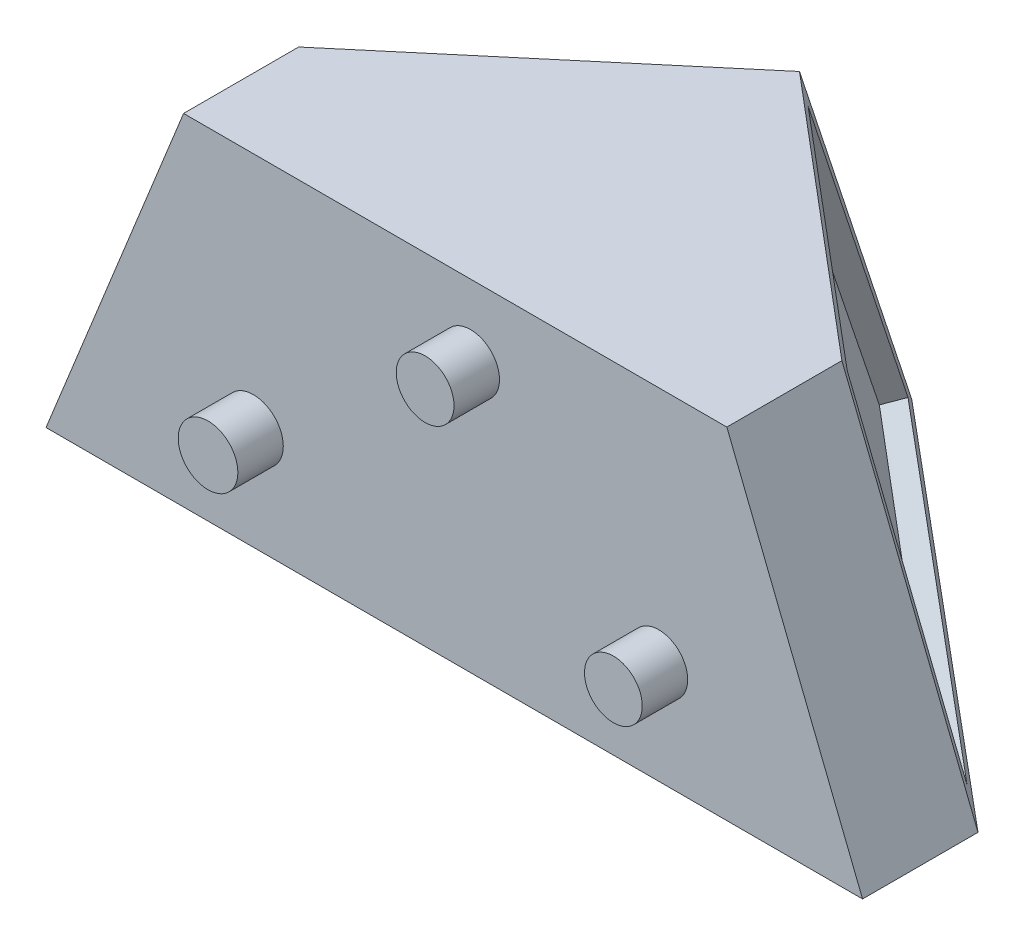
ISO-10303-21;
HEADER;
FILE_DESCRIPTION(('STEP AP214'),'2;1');
FILE_NAME('part.step','',(''),(''),'','','');
FILE_SCHEMA(('AUTOMOTIVE_DESIGN { 1 0 10303 214 1 1 1 1 }'));
ENDSEC;
DATA;
#1=APPLICATION_CONTEXT('core data for automotive mechanical design processes');
#2=APPLICATION_PROTOCOL_DEFINITION('international standard','automotive_design',2000,#1);
#3=PRODUCT_CONTEXT('',#1,'mechanical');
#4=PRODUCT('Part','Part','',(#3));
#5=PRODUCT_RELATED_PRODUCT_CATEGORY('part','',(#4));
#6=PRODUCT_DEFINITION_FORMATION('','',#4);
#7=PRODUCT_DEFINITION_CONTEXT('part definition',#1,'design');
#8=PRODUCT_DEFINITION('design','',#6,#7);
#9=PRODUCT_DEFINITION_SHAPE('','',#8);
#10=(LENGTH_UNIT() NAMED_UNIT(*) SI_UNIT(.MILLI.,.METRE.));
#11=(NAMED_UNIT(*) PLANE_ANGLE_UNIT() SI_UNIT($,.RADIAN.));
#12=(NAMED_UNIT(*) SI_UNIT($,.STERADIAN.) SOLID_ANGLE_UNIT());
#13=UNCERTAINTY_MEASURE_WITH_UNIT(LENGTH_MEASURE(1.E-05),#10,'distance_accuracy_value','');
#14=(GEOMETRIC_REPRESENTATION_CONTEXT(3) GLOBAL_UNCERTAINTY_ASSIGNED_CONTEXT((#13)) GLOBAL_UNIT_ASSIGNED_CONTEXT((#10,
#11,#12)) REPRESENTATION_CONTEXT('',''));
#15=CARTESIAN_POINT('',(0.,0.,0.));
#16=DIRECTION('',(0.,0.,1.));
#17=DIRECTION('',(1.,0.,0.));
#18=AXIS2_PLACEMENT_3D('',#15,#16,#17);
#19=CARTESIAN_POINT('',(0.,0.,0.));
#20=DIRECTION('',(0.,1.,0.));
#21=DIRECTION('',(0.,0.,1.));
#22=AXIS2_PLACEMENT_3D('',#19,#20,#21);
#23=PLANE('',#22);
#24=DIRECTION('',(0.,0.,-1.));
#25=VECTOR('',#24,1.);
#26=CARTESIAN_POINT('',(7.18186926341713,0.,0.));
#27=LINE('',#26,#25);
#28=CARTESIAN_POINT('',(7.18186926341713,0.,17.291697394923));
#29=VERTEX_POINT('',#28);
#30=CARTESIAN_POINT('',(7.18186926341713,0.,16.2214554712721));
#31=VERTEX_POINT('',#30);
#32=EDGE_CURVE('E206',#29,#31,#27,.T.);
#33=ORIENTED_EDGE('',*,*,#32,.T.);
#34=DIRECTION('',(-0.764230909917112,0.,-0.64494272329197));
#35=VECTOR('',#34,1.);
#36=CARTESIAN_POINT('',(-5.0080082071542,0.,5.93428614790834));
#37=LINE('',#36,#35);
#38=CARTESIAN_POINT('',(-12.8999344347289,0.,-0.725795677077533));
#39=VERTEX_POINT('',#38);
#40=EDGE_CURVE('E222',#31,#39,#37,.T.);
#41=ORIENTED_EDGE('',*,*,#40,.T.);
#42=DIRECTION('',(0.764230909917112,0.,-0.644942723291971));
#43=VECTOR('',#42,1.);
#44=CARTESIAN_POINT('',(-5.72347605019381,0.,-6.7820864578516));
#45=LINE('',#44,#43);
#46=CARTESIAN_POINT('',(-32.9818014445838,0.,16.2215089007073));
#47=VERTEX_POINT('',#46);
#48=EDGE_CURVE('E220',#47,#39,#45,.T.);
#49=ORIENTED_EDGE('',*,*,#48,.F.);
#50=DIRECTION('',(0.,0.,1.));
#51=VECTOR('',#50,1.);
#52=CARTESIAN_POINT('',(-32.9818014445838,0.,0.));
#53=LINE('',#52,#51);
#54=CARTESIAN_POINT('',(-32.9818014445838,0.,17.291697394923));
#55=VERTEX_POINT('',#54);
#56=EDGE_CURVE('E71',#47,#55,#53,.T.);
#57=ORIENTED_EDGE('',*,*,#56,.T.);
#58=DIRECTION('',(1.,0.,0.));
#59=VECTOR('',#58,1.);
#60=CARTESIAN_POINT('',(0.,0.,17.291697394923));
#61=LINE('',#60,#59);
#62=EDGE_CURVE('E201',#55,#29,#61,.T.);
#63=ORIENTED_EDGE('',*,*,#62,.T.);
#64=EDGE_LOOP('',(#33,#41,#49,#57,#63));
#65=FACE_BOUND('',#64,.T.);
#66=DIRECTION('',(0.,0.,1.));
#67=VECTOR('',#66,1.);
#68=CARTESIAN_POINT('',(-35.7209489221806,0.,13.3804223387432));
#69=LINE('',#68,#67);
#70=CARTESIAN_POINT('',(-35.7209489221806,0.,13.3804223387432));
#71=VERTEX_POINT('',#70);
#72=CARTESIAN_POINT('',(-35.7209489221806,0.,19.831697394923));
#73=VERTEX_POINT('',#72);
#74=EDGE_CURVE('E498',#71,#73,#69,.T.);
#75=ORIENTED_EDGE('',*,*,#74,.F.);
#76=DIRECTION('',(-0.766573876706374,0.,0.642156127083874));
#77=VECTOR('',#76,1.);
#78=CARTESIAN_POINT('',(-12.9025501123596,0.,-5.73446671660424));
#79=LINE('',#78,#77);
#80=CARTESIAN_POINT('',(-12.9025501123596,0.,-5.73446671660424));
#81=VERTEX_POINT('',#80);
#82=EDGE_CURVE('E561',#81,#71,#79,.T.);
#83=ORIENTED_EDGE('',*,*,#82,.F.);
#84=DIRECTION('',(-0.766573876706374,0.,-0.642156127083874));
#85=VECTOR('',#84,1.);
#86=CARTESIAN_POINT('',(-12.9025501123596,0.,-5.73446671660424));
#87=LINE('',#86,#85);
#88=CARTESIAN_POINT('',(9.91584869746151,0.,13.3804223387432));
#89=VERTEX_POINT('',#88);
#90=EDGE_CURVE('E475',#89,#81,#87,.T.);
#91=ORIENTED_EDGE('',*,*,#90,.F.);
#92=DIRECTION('',(0.,0.,-1.));
#93=VECTOR('',#92,1.);
#94=CARTESIAN_POINT('',(9.91584869746151,0.,19.831697394923));
#95=LINE('',#94,#93);
#96=CARTESIAN_POINT('',(9.91584869746151,0.,19.831697394923));
#97=VERTEX_POINT('',#96);
#98=EDGE_CURVE('E551',#97,#89,#95,.T.);
#99=ORIENTED_EDGE('',*,*,#98,.F.);
#100=DIRECTION('',(1.,0.,0.));
#101=VECTOR('',#100,1.);
#102=CARTESIAN_POINT('',(-35.7209489221806,0.,19.831697394923));
#103=LINE('',#102,#101);
#104=EDGE_CURVE('E530',#73,#97,#103,.T.);
#105=ORIENTED_EDGE('',*,*,#104,.F.);
#106=EDGE_LOOP('',(#75,#83,#91,#99,#105));
#107=FACE_BOUND('',#106,.T.);
#108=ADVANCED_FACE('F50',(#65,#107),#23,.F.);
#109=CARTESIAN_POINT('',(0.,19.05,0.));
#110=DIRECTION('',(0.,-1.,0.));
#111=DIRECTION('',(0.,0.,-1.));
#112=AXIS2_PLACEMENT_3D('',#109,#110,#111);
#113=PLANE('',#112);
#114=DIRECTION('',(0.,0.,-1.));
#115=VECTOR('',#114,1.);
#116=CARTESIAN_POINT('',(2.32992756354559,19.05,13.4019906432975));
#117=LINE('',#116,#115);
#118=CARTESIAN_POINT('',(2.32992756354559,19.05,19.831697394923));
#119=VERTEX_POINT('',#118);
#120=CARTESIAN_POINT('',(2.32992756354559,19.05,13.4019906432975));
#121=VERTEX_POINT('',#120);
#122=EDGE_CURVE('E286',#119,#121,#117,.T.);
#123=ORIENTED_EDGE('',*,*,#122,.T.);
#124=DIRECTION('',(-0.764230909917112,0.,-0.644942723291971));
#125=VECTOR('',#124,1.);
#126=CARTESIAN_POINT('',(-12.8504732656043,19.05,0.591086341510654));
#127=LINE('',#126,#125);
#128=CARTESIAN_POINT('',(-12.8504732656043,19.05,0.591086341510654));
#129=VERTEX_POINT('',#128);
#130=EDGE_CURVE('E294',#121,#129,#127,.T.);
#131=ORIENTED_EDGE('',*,*,#130,.T.);
#132=DIRECTION('',(-0.764230909917112,0.,0.644942723291971));
#133=VECTOR('',#132,1.);
#134=CARTESIAN_POINT('',(-28.0308740947542,19.05,13.4019906432975));
#135=LINE('',#134,#133);
#136=CARTESIAN_POINT('',(-28.0308740947542,19.05,13.4019906432975));
#137=VERTEX_POINT('',#136);
#138=EDGE_CURVE('E449',#129,#137,#135,.T.);
#139=ORIENTED_EDGE('',*,*,#138,.T.);
#140=DIRECTION('',(0.,0.,1.));
#141=VECTOR('',#140,1.);
#142=CARTESIAN_POINT('',(-28.0308740947542,19.05,19.831697394923));
#143=LINE('',#142,#141);
#144=CARTESIAN_POINT('',(-28.0308740947542,19.05,19.831697394923));
#145=VERTEX_POINT('',#144);
#146=EDGE_CURVE('E447',#137,#145,#143,.T.);
#147=ORIENTED_EDGE('',*,*,#146,.T.);
#148=DIRECTION('',(1.,0.,0.));
#149=VECTOR('',#148,1.);
#150=CARTESIAN_POINT('',(2.32992756354559,19.05,19.831697394923));
#151=LINE('',#150,#149);
#152=EDGE_CURVE('E440',#145,#119,#151,.T.);
#153=ORIENTED_EDGE('',*,*,#152,.T.);
#154=EDGE_LOOP('',(#123,#131,#139,#147,#153));
#155=FACE_BOUND('',#154,.T.);
#156=ADVANCED_FACE('F410',(#155),#113,.F.);
#157=CARTESIAN_POINT('',(-28.0308740947542,19.05,13.4019906432975));
#158=CARTESIAN_POINT('',(-35.7209489221806,0.,13.3804223387432));
#159=CARTESIAN_POINT('',(-25.5008072898959,19.05,11.2668399263331));
#160=CARTESIAN_POINT('',(-31.9178824538771,0.,10.1946074961853));
#161=CARTESIAN_POINT('',(-22.9707404850376,19.05,9.13168920936857));
#162=CARTESIAN_POINT('',(-28.1148159855736,0.,7.00879265362741));
#163=CARTESIAN_POINT('',(-17.9106068753209,19.05,4.86138777543961));
#164=CARTESIAN_POINT('',(-20.5086830489666,0.,0.637162968511586));
#165=CARTESIAN_POINT('',(-15.3805400704626,19.05,2.72623705847513));
#166=CARTESIAN_POINT('',(-16.7056165806631,0.,-2.54865187404633));
#167=CARTESIAN_POINT('',(-12.8504732656043,19.05,0.591086341510654));
#168=CARTESIAN_POINT('',(-12.9025501123596,0.,-5.73446671660424));
#169=B_SPLINE_SURFACE_WITH_KNOTS('',3,1,((#157,#158),(#159,#160),(#161,#162),(#163,#164),(#165,
#166),(#167,#168)),.UNSPECIFIED.,.F.,.F.,.F.,(4,2,4),(2,2),(0.,0.5,1.),(0.,1.),.UNSPECIFIED.);
#170=CARTESIAN_POINT('',(-27.5636282149871,18.449611004177,12.8026689982938));
#171=CARTESIAN_POINT('',(-26.2560882513539,18.4437987318795,11.6976168299691));
#172=CARTESIAN_POINT('',(-24.9485432804806,18.4379844311436,10.5925705970762));
#173=CARTESIAN_POINT('',(-22.3334433273953,18.4263517740234,8.38248999865382));
#174=CARTESIAN_POINT('',(-21.0258883451833,18.4205334176392,7.27745563312426));
#175=CARTESIAN_POINT('',(-17.6397076810302,18.4054604033297,4.41576977980642));
#176=CARTESIAN_POINT('',(-15.5610743571901,18.3962026495954,2.65912735083677));
#177=CARTESIAN_POINT('',(-13.4824283936629,18.3869397753101,0.902499905585738));
#178=B_SPLINE_CURVE_WITH_KNOTS('',3,(#170,#171,#172,#173,#174,#175,#176,#177),.UNSPECIFIED.,.F.,
.F.,(4,2,2,4),(0.,5.13590435106401,10.271808702128,18.4363266556524),.UNSPECIFIED.);
#179=CARTESIAN_POINT('',(-27.475383905779,18.4492187378212,12.7280903637891));
#180=VERTEX_POINT('',#179);
#181=CARTESIAN_POINT('',(-13.5762192802991,18.38735772337,0.981760965274857));
#182=VERTEX_POINT('',#181);
#183=EDGE_CURVE('E12',#180,#182,#178,.T.);
#184=CARTESIAN_POINT('',(-34.437754572103,1.0748603767914,12.6699849129351));
#185=CARTESIAN_POINT('',(-33.8009028224224,2.66395628345924,12.6753590345148));
#186=CARTESIAN_POINT('',(-33.1640591422822,4.25305545706993,12.680723594578));
#187=CARTESIAN_POINT('',(-31.8903973696077,7.43126416053994,12.691422397371));
#188=CARTESIAN_POINT('',(-31.2535792770733,9.02037369039925,12.6967566401007));
#189=CARTESIAN_POINT('',(-29.5555199789844,13.257829432599,12.7109253079996));
#190=CARTESIAN_POINT('',(-28.4943099097686,15.9061882452433,12.719722842148));
#191=CARTESIAN_POINT('',(-27.4331703619465,18.5545755934793,12.7284368222598));
#192=B_SPLINE_CURVE_WITH_KNOTS('',3,(#184,#185,#186,#187,#188,#189,#190,#191),.UNSPECIFIED.,.F.,
.F.,(4,2,2,4),(0.,5.1359043512615,10.2718087027087,18.8310398270017),.UNSPECIFIED.);
#193=CARTESIAN_POINT('',(-34.3807805909469,1.2170237711916,12.6704657646512));
#194=VERTEX_POINT('',#193);
#195=EDGE_CURVE('E64',#194,#180,#192,.T.);
#196=CARTESIAN_POINT('',(-13.295185393923,1.10110353015909,-5.03731817788629));
#197=CARTESIAN_POINT('',(-15.9171705577739,1.11553088837307,-2.83542694830103));
#198=CARTESIAN_POINT('',(-18.5391439048373,1.12995344074907,-0.633521615947996));
#199=CARTESIAN_POINT('',(-23.3863869382941,1.15660764238197,3.43718600952355));
#200=CARTESIAN_POINT('',(-25.61165993415,1.16884063756536,5.30598435304903));
#201=CARTESIAN_POINT('',(-30.0621888609088,1.19329968777894,9.04360140583633));
#202=CARTESIAN_POINT('',(-32.2874447918117,1.20552574280912,10.9124201150982));
#203=CARTESIAN_POINT('',(-34.512692180559,1.21774832390537,12.7812490183786));
#204=B_SPLINE_CURVE_WITH_KNOTS('',3,(#196,#197,#198,#199,#200,#201,#202,#203),.UNSPECIFIED.,.F.,
.F.,(4,2,2,4),(0.,10.2718087021737,18.9895819962525,27.7073552911095),.UNSPECIFIED.);
#205=CARTESIAN_POINT('',(-13.5184507410828,1.10233202646824,-4.84982430155932));
#206=VERTEX_POINT('',#205);
#207=EDGE_CURVE('E645',#206,#194,#204,.T.);
#208=CARTESIAN_POINT('',(-13.5765678351061,18.4937319131046,1.01765847428869));
#209=CARTESIAN_POINT('',(-13.5712512854432,16.8716451022924,0.470263776260042));
#210=CARTESIAN_POINT('',(-13.5658961392674,15.2495429526188,-0.0770850861509815));
#211=CARTESIAN_POINT('',(-13.555124494524,12.005314273665,-1.17170995046045));
#212=CARTESIAN_POINT('',(-13.5497079959563,10.3831877443848,-1.71898595235892));
#213=CARTESIAN_POINT('',(-13.5352590078876,6.0741013197456,-3.17271348369392));
#214=CARTESIAN_POINT('',(-13.5261868377312,3.38712565864694,-4.07911788867063));
#215=CARTESIAN_POINT('',(-13.5170882275348,0.700139501301185,-4.98549089064216));
#216=B_SPLINE_CURVE_WITH_KNOTS('',3,(#208,#209,#210,#211,#212,#213,#214,#215),.UNSPECIFIED.,.F.,
.F.,(4,2,2,4),(0.,5.13590435432239,10.2718087070014,18.7790647203494),.UNSPECIFIED.);
#217=EDGE_CURVE('E650',#182,#206,#216,.T.);
#218=DIRECTION('',(-0.00259439700830702,-0.949044845985807,-0.315130368914105));
#219=VECTOR('',#218,1.);
#220=CARTESIAN_POINT('',(-12.8765116889819,9.525,-2.57169018754679));
#221=LINE('',#220,#219);
#222=EDGE_CURVE('E300',#129,#81,#221,.T.);
#223=DIRECTION('',(0.374329149350187,0.927295306631961,0.00104987861339673));
#224=VECTOR('',#223,1.);
#225=CARTESIAN_POINT('',(-31.8759115084674,9.525,13.3912064910204));
#226=LINE('',#225,#224);
#227=EDGE_CURVE('E455',#71,#137,#226,.T.);
#228=ORIENTED_EDGE('',*,*,#183,.F.);
#229=ORIENTED_EDGE('',*,*,#195,.F.);
#230=ORIENTED_EDGE('',*,*,#207,.F.);
#231=ORIENTED_EDGE('',*,*,#217,.F.);
#232=EDGE_LOOP('',(#228,#229,#230,#231));
#233=FACE_BOUND('',#232,.T.);
#234=ORIENTED_EDGE('',*,*,#138,.F.);
#235=ORIENTED_EDGE('',*,*,#222,.T.);
#236=ORIENTED_EDGE('',*,*,#82,.T.);
#237=ORIENTED_EDGE('',*,*,#227,.T.);
#238=EDGE_LOOP('',(#234,#235,#236,#237));
#239=FACE_BOUND('',#238,.T.);
#240=ADVANCED_FACE('F314',(#233,#239),#169,.T.);
#241=CARTESIAN_POINT('',(-12.8504732656043,19.05,0.591086341510654));
#242=CARTESIAN_POINT('',(-12.9025501123596,0.,-5.73446671660424));
#243=CARTESIAN_POINT('',(-10.320406460746,19.05,2.72623705847514));
#244=CARTESIAN_POINT('',(-9.09948364405598,0.,-2.54865187404628));
#245=CARTESIAN_POINT('',(-7.79033965588767,19.05,4.86138777543962));
#246=CARTESIAN_POINT('',(-5.29641717575244,0.,0.637162968511659));
#247=CARTESIAN_POINT('',(-2.73020604617103,19.05,9.13168920936858));
#248=CARTESIAN_POINT('',(2.30971576085458,0.,7.00879265362749));
#249=CARTESIAN_POINT('',(-0.200139241312718,19.05,11.2668399263331));
#250=CARTESIAN_POINT('',(6.11278222915806,0.,10.1946074961854));
#251=CARTESIAN_POINT('',(2.3299275635456,19.05,13.4019906432975));
#252=CARTESIAN_POINT('',(9.91584869746151,0.,13.3804223387432));
#253=B_SPLINE_SURFACE_WITH_KNOTS('',3,1,((#241,#242),(#243,#244),(#245,#246),(#247,#248),(#249,
#250),(#251,#252)),.UNSPECIFIED.,.F.,.F.,.F.,(4,2,4),(2,2),(0.,0.5,1.),(0.,1.),.UNSPECIFIED.);
#254=CARTESIAN_POINT('',(-12.0677801085247,17.9968043121745,0.903930889331428));
#255=CARTESIAN_POINT('',(-10.7609055155217,17.992594380505,2.00477008751305));
#256=CARTESIAN_POINT('',(-9.45402737739816,17.9883858657734,3.10560508247793));
#257=CARTESIAN_POINT('',(-6.840264024894,17.9799716646188,5.30726668244283));
#258=CARTESIAN_POINT('',(-5.53337881051339,17.9757659781958,6.40809328744285));
#259=CARTESIAN_POINT('',(-2.17423452280316,17.9649595751457,9.23757770280608));
#260=CARTESIAN_POINT('',(-0.121970272976445,17.9583609275285,10.9662293755733));
#261=CARTESIAN_POINT('',(1.93030265740808,17.951765749513,12.6948707558829));
#262=B_SPLINE_CURVE_WITH_KNOTS('',3,(#254,#255,#256,#257,#258,#259,#260,#261),.UNSPECIFIED.,.F.,
.F.,(4,2,2,4),(0.,5.12621427472549,10.2524285494509,18.302311672143),.UNSPECIFIED.);
#263=CARTESIAN_POINT('',(-11.972595975708,17.9964976910212,0.984108749088986));
#264=VERTEX_POINT('',#263);
#265=CARTESIAN_POINT('',(1.84244895396489,17.9520480780416,12.6208710616909));
#266=VERTEX_POINT('',#265);
#267=EDGE_CURVE('E360',#264,#266,#262,.T.);
#268=CARTESIAN_POINT('',(-12.0299878800122,0.664713766755421,-4.7842014071602));
#269=CARTESIAN_POINT('',(-12.0245532499294,2.28603391346159,-4.24468559570343));
#270=CARTESIAN_POINT('',(-12.0191294691585,3.90734981013438,-3.70515689964664));
#271=CARTESIAN_POINT('',(-12.008316502527,7.14996804691505,-2.62605842430464));
#272=CARTESIAN_POINT('',(-12.0029273166663,8.77127038702291,-2.08648864501941));
#273=CARTESIAN_POINT('',(-11.9890581928219,12.9621499366286,-0.691682102454641));
#274=CARTESIAN_POINT('',(-11.9806141559612,15.531713075357,0.163597294457516));
#275=CARTESIAN_POINT('',(-11.9722554366493,18.1012427711977,1.01897800700885));
#276=B_SPLINE_CURVE_WITH_KNOTS('',3,(#268,#269,#270,#271,#272,#273,#274,#275),.UNSPECIFIED.,.F.,
.F.,(4,2,2,4),(0.,5.12621427515897,10.2524285506622,18.3769629866101),.UNSPECIFIED.);
#277=CARTESIAN_POINT('',(-12.0286586797866,1.06123756158741,-4.65225292877467));
#278=VERTEX_POINT('',#277);
#279=EDGE_CURVE('E354',#278,#264,#276,.T.);
#280=CARTESIAN_POINT('',(8.54045495123489,1.09652721536378,12.5950532462572));
#281=CARTESIAN_POINT('',(5.92176170655914,1.09203826865516,10.3992461049153));
#282=CARTESIAN_POINT('',(3.30306478513752,1.08754784678505,8.20344335143308));
#283=CARTESIAN_POINT('',(-1.47113308267934,1.07935859173652,4.20024578346012));
#284=CARTESIAN_POINT('',(-3.62663284309402,1.07566023439196,2.39284955360003));
#285=CARTESIAN_POINT('',(-7.93763734846712,1.06826151982644,-1.22193695748156));
#286=CARTESIAN_POINT('',(-10.0931420934255,1.06456116260549,-3.02932723870305));
#287=CARTESIAN_POINT('',(-12.2486493311833,1.06085980522777,-4.83671454494046));
#288=B_SPLINE_CURVE_WITH_KNOTS('',3,(#280,#281,#282,#283,#284,#285,#286,#287),.UNSPECIFIED.,.F.,
.F.,(4,2,2,4),(0.,10.2524285494098,18.6913779058271,27.1303272623129),.UNSPECIFIED.);
#289=CARTESIAN_POINT('',(8.41045032857142,1.09630436108931,12.4860427451763));
#290=VERTEX_POINT('',#289);
#291=EDGE_CURVE('E347',#290,#278,#288,.T.);
#292=CARTESIAN_POINT('',(1.8022723505291,18.0551668198981,12.6216911763009));
#293=CARTESIAN_POINT('',(2.42258585458345,16.463049780088,12.609027966861));
#294=CARTESIAN_POINT('',(3.04292170471704,14.8709416580555,12.59633828241));
#295=CARTESIAN_POINT('',(4.28362903437398,11.6867396339129,12.5709167003705));
#296=CARTESIAN_POINT('',(4.90400051389732,10.0946457318027,12.558184802782));
#297=CARTESIAN_POINT('',(6.50510852466216,5.98573467536665,12.5252853138125));
#298=CARTESIAN_POINT('',(7.48586496802273,3.46892546884101,12.5050941305759));
#299=CARTESIAN_POINT('',(8.46663670560821,0.95212236991942,12.4848848255783));
#300=B_SPLINE_CURVE_WITH_KNOTS('',3,(#292,#293,#294,#295,#296,#297,#298,#299),.UNSPECIFIED.,.F.,
.F.,(4,2,2,4),(0.,5.12621427580132,10.252428551066,18.3561051949027),.UNSPECIFIED.);
#301=EDGE_CURVE('E339',#266,#290,#300,.T.);
#302=DIRECTION('',(0.369957278773914,-0.929048171768296,-0.00105186319760162));
#303=VECTOR('',#302,1.);
#304=CARTESIAN_POINT('',(6.12288813050355,9.525,13.3912064910204));
#305=LINE('',#304,#303);
#306=EDGE_CURVE('E476',#121,#89,#305,.T.);
#307=ORIENTED_EDGE('',*,*,#267,.F.);
#308=ORIENTED_EDGE('',*,*,#279,.F.);
#309=ORIENTED_EDGE('',*,*,#291,.F.);
#310=ORIENTED_EDGE('',*,*,#301,.F.);
#311=EDGE_LOOP('',(#307,#308,#309,#310));
#312=FACE_BOUND('',#311,.T.);
#313=ORIENTED_EDGE('',*,*,#130,.F.);
#314=ORIENTED_EDGE('',*,*,#306,.T.);
#315=ORIENTED_EDGE('',*,*,#90,.T.);
#316=ORIENTED_EDGE('',*,*,#222,.F.);
#317=EDGE_LOOP('',(#313,#314,#315,#316));
#318=FACE_BOUND('',#317,.T.);
#319=ADVANCED_FACE('F302',(#312,#318),#253,.T.);
#320=CARTESIAN_POINT('',(-30.7156414533935,12.3992431049342,0.));
#321=DIRECTION('',(-0.927295817685739,0.374329355651594,0.));
#322=DIRECTION('',(-0.374329355651594,-0.927295817685739,0.));
#323=AXIS2_PLACEMENT_3D('',#320,#321,#322);
#324=PLANE('',#323);
#325=ORIENTED_EDGE('',*,*,#227,.F.);
#326=ORIENTED_EDGE('',*,*,#74,.T.);
#327=DIRECTION('',(-0.374329355651594,-0.927295817685739,0.));
#328=VECTOR('',#327,1.);
#329=CARTESIAN_POINT('',(-28.0308740947542,19.05,19.831697394923));
#330=LINE('',#329,#328);
#331=EDGE_CURVE('E495',#145,#73,#330,.T.);
#332=ORIENTED_EDGE('',*,*,#331,.F.);
#333=ORIENTED_EDGE('',*,*,#146,.F.);
#334=EDGE_LOOP('',(#325,#326,#332,#333));
#335=FACE_BOUND('',#334,.T.);
#336=ADVANCED_FACE('F313',(#335),#324,.T.);
#337=CARTESIAN_POINT('',(8.55868096782763,3.40816161849278,0.));
#338=DIRECTION('',(0.929048685725691,0.369957483437445,0.));
#339=DIRECTION('',(-0.369957483437445,0.929048685725691,0.));
#340=AXIS2_PLACEMENT_3D('',#337,#338,#339);
#341=PLANE('',#340);
#342=DIRECTION('',(0.369957483437445,-0.92904868572569,0.));
#343=VECTOR('',#342,1.);
#344=CARTESIAN_POINT('',(2.32992756354559,19.05,19.831697394923));
#345=LINE('',#344,#343);
#346=EDGE_CURVE('E477',#119,#97,#345,.T.);
#347=ORIENTED_EDGE('',*,*,#346,.T.);
#348=ORIENTED_EDGE('',*,*,#98,.T.);
#349=ORIENTED_EDGE('',*,*,#306,.F.);
#350=ORIENTED_EDGE('',*,*,#122,.F.);
#351=EDGE_LOOP('',(#347,#348,#349,#350));
#352=FACE_BOUND('',#351,.T.);
#353=ADVANCED_FACE('F511',(#352),#341,.T.);
#354=CARTESIAN_POINT('',(0.,0.,19.831697394923));
#355=DIRECTION('',(0.,0.,1.));
#356=DIRECTION('',(1.,0.,0.));
#357=AXIS2_PLACEMENT_3D('',#354,#355,#356);
#358=PLANE('',#357);
#359=CARTESIAN_POINT('',(-24.1251105881119,5.7233901868682,19.831697394923));
#360=DIRECTION('',(0.,0.,1.));
#361=DIRECTION('',(1.,0.,0.));
#362=AXIS2_PLACEMENT_3D('',#359,#360,#361);
#363=CIRCLE('',#362,1.6664590961674);
#364=CARTESIAN_POINT('',(-22.4586514919445,5.7233901868682,19.831697394923));
#365=VERTEX_POINT('',#364);
#366=EDGE_CURVE('E263',#365,#365,#363,.T.);
#367=ORIENTED_EDGE('',*,*,#366,.F.);
#368=EDGE_LOOP('',(#367));
#369=FACE_BOUND('',#368,.T.);
#370=CARTESIAN_POINT('',(-1.47168224958629,5.7233901868682,19.831697394923));
#371=DIRECTION('',(0.,0.,1.));
#372=DIRECTION('',(1.,0.,0.));
#373=AXIS2_PLACEMENT_3D('',#370,#371,#372);
#374=CIRCLE('',#373,1.61438224941217);
#375=CARTESIAN_POINT('',(0.142699999825878,5.7233901868682,19.831697394923));
#376=VERTEX_POINT('',#375);
#377=EDGE_CURVE('E274',#376,#376,#374,.T.);
#378=ORIENTED_EDGE('',*,*,#377,.F.);
#379=EDGE_LOOP('',(#378));
#380=FACE_BOUND('',#379,.T.);
#381=CARTESIAN_POINT('',(-11.991205294143,14.9930689092994,19.831697394923));
#382=DIRECTION('',(0.,0.,1.));
#383=DIRECTION('',(1.,0.,0.));
#384=AXIS2_PLACEMENT_3D('',#381,#382,#383);
#385=CIRCLE('',#384,1.61438224941217);
#386=CARTESIAN_POINT('',(-10.3768230447308,14.9930689092994,19.831697394923));
#387=VERTEX_POINT('',#386);
#388=EDGE_CURVE('E280',#387,#387,#385,.T.);
#389=ORIENTED_EDGE('',*,*,#388,.F.);
#390=EDGE_LOOP('',(#389));
#391=FACE_BOUND('',#390,.T.);
#392=ORIENTED_EDGE('',*,*,#331,.T.);
#393=ORIENTED_EDGE('',*,*,#104,.T.);
#394=ORIENTED_EDGE('',*,*,#346,.F.);
#395=ORIENTED_EDGE('',*,*,#152,.F.);
#396=EDGE_LOOP('',(#392,#393,#394,#395));
#397=FACE_BOUND('',#396,.T.);
#398=ADVANCED_FACE('F408',(#369,#380,#391,#397),#358,.T.);
#399=CARTESIAN_POINT('',(-11.991205294143,14.9930689092994,22.371697394923));
#400=DIRECTION('',(0.,0.,-1.));
#401=DIRECTION('',(-1.,0.,0.));
#402=AXIS2_PLACEMENT_3D('',#399,#400,#401);
#403=CYLINDRICAL_SURFACE('',#402,1.61438224941217);
#404=CARTESIAN_POINT('',(-11.991205294143,14.9930689092994,22.371697394923));
#405=DIRECTION('',(0.,0.,1.));
#406=DIRECTION('',(1.,0.,0.));
#407=AXIS2_PLACEMENT_3D('',#404,#405,#406);
#408=CIRCLE('',#407,1.61438224941217);
#409=CARTESIAN_POINT('',(-10.3768230447308,14.9930689092994,22.371697394923));
#410=VERTEX_POINT('',#409);
#411=EDGE_CURVE('E283',#410,#410,#408,.T.);
#412=ORIENTED_EDGE('',*,*,#411,.F.);
#413=EDGE_LOOP('',(#412));
#414=FACE_BOUND('',#413,.T.);
#415=ORIENTED_EDGE('',*,*,#388,.T.);
#416=EDGE_LOOP('',(#415));
#417=FACE_BOUND('',#416,.T.);
#418=ADVANCED_FACE('F405',(#414,#417),#403,.T.);
#419=CARTESIAN_POINT('',(-11.991205294143,14.9930689092994,22.371697394923));
#420=DIRECTION('',(0.,0.,1.));
#421=DIRECTION('',(1.,0.,0.));
#422=AXIS2_PLACEMENT_3D('',#419,#420,#421);
#423=PLANE('',#422);
#424=ORIENTED_EDGE('',*,*,#411,.T.);
#425=EDGE_LOOP('',(#424));
#426=FACE_BOUND('',#425,.T.);
#427=ADVANCED_FACE('F401',(#426),#423,.T.);
#428=CARTESIAN_POINT('',(-1.47168224958629,5.7233901868682,22.371697394923));
#429=DIRECTION('',(0.,0.,-1.));
#430=DIRECTION('',(-1.,0.,0.));
#431=AXIS2_PLACEMENT_3D('',#428,#429,#430);
#432=CYLINDRICAL_SURFACE('',#431,1.61438224941217);
#433=CARTESIAN_POINT('',(-1.47168224958629,5.7233901868682,22.371697394923));
#434=DIRECTION('',(0.,0.,1.));
#435=DIRECTION('',(1.,0.,0.));
#436=AXIS2_PLACEMENT_3D('',#433,#434,#435);
#437=CIRCLE('',#436,1.61438224941217);
#438=CARTESIAN_POINT('',(0.142699999825878,5.7233901868682,22.371697394923));
#439=VERTEX_POINT('',#438);
#440=EDGE_CURVE('E277',#439,#439,#437,.T.);
#441=ORIENTED_EDGE('',*,*,#440,.F.);
#442=EDGE_LOOP('',(#441));
#443=FACE_BOUND('',#442,.T.);
#444=ORIENTED_EDGE('',*,*,#377,.T.);
#445=EDGE_LOOP('',(#444));
#446=FACE_BOUND('',#445,.T.);
#447=ADVANCED_FACE('F397',(#443,#446),#432,.T.);
#448=CARTESIAN_POINT('',(-1.47168224958629,5.7233901868682,22.371697394923));
#449=DIRECTION('',(0.,0.,1.));
#450=DIRECTION('',(1.,0.,0.));
#451=AXIS2_PLACEMENT_3D('',#448,#449,#450);
#452=PLANE('',#451);
#453=ORIENTED_EDGE('',*,*,#440,.T.);
#454=EDGE_LOOP('',(#453));
#455=FACE_BOUND('',#454,.T.);
#456=ADVANCED_FACE('F393',(#455),#452,.T.);
#457=CARTESIAN_POINT('',(-24.1251105881119,5.7233901868682,22.371697394923));
#458=DIRECTION('',(0.,0.,-1.));
#459=DIRECTION('',(-1.,0.,0.));
#460=AXIS2_PLACEMENT_3D('',#457,#458,#459);
#461=CYLINDRICAL_SURFACE('',#460,1.6664590961674);
#462=CARTESIAN_POINT('',(-24.1251105881119,5.7233901868682,22.371697394923));
#463=DIRECTION('',(0.,0.,1.));
#464=DIRECTION('',(1.,0.,0.));
#465=AXIS2_PLACEMENT_3D('',#462,#463,#464);
#466=CIRCLE('',#465,1.6664590961674);
#467=CARTESIAN_POINT('',(-22.4586514919445,5.7233901868682,22.371697394923));
#468=VERTEX_POINT('',#467);
#469=EDGE_CURVE('E271',#468,#468,#466,.T.);
#470=ORIENTED_EDGE('',*,*,#469,.F.);
#471=EDGE_LOOP('',(#470));
#472=FACE_BOUND('',#471,.T.);
#473=ORIENTED_EDGE('',*,*,#366,.T.);
#474=EDGE_LOOP('',(#473));
#475=FACE_BOUND('',#474,.T.);
#476=ADVANCED_FACE('F389',(#472,#475),#461,.T.);
#477=CARTESIAN_POINT('',(-24.1251105881119,5.7233901868682,22.371697394923));
#478=DIRECTION('',(0.,0.,1.));
#479=DIRECTION('',(1.,0.,0.));
#480=AXIS2_PLACEMENT_3D('',#477,#478,#479);
#481=PLANE('',#480);
#482=ORIENTED_EDGE('',*,*,#469,.T.);
#483=EDGE_LOOP('',(#482));
#484=FACE_BOUND('',#483,.T.);
#485=ADVANCED_FACE('F385',(#484),#481,.T.);
#486=CARTESIAN_POINT('',(-12.7623420549623,17.6809525225638,1.9199257495061));
#487=DIRECTION('',(-0.158938470570543,0.968362031052948,0.192389031360171));
#488=DIRECTION('',(0.,-0.194866073392249,0.980829859578452));
#489=AXIS2_PLACEMENT_3D('',#486,#487,#488);
#490=PLANE('',#489);
#491=ORIENTED_EDGE('',*,*,#267,.T.);
#492=DIRECTION('',(0.624540179532858,0.249536707222686,-0.740054724934261));
#493=VECTOR('',#492,1.);
#494=CARTESIAN_POINT('',(1.04950654165362,17.6352258061208,13.5604755868483));
#495=LINE('',#494,#493);
#496=CARTESIAN_POINT('',(1.04950654165362,17.6352258061208,13.5604755868483));
#497=VERTEX_POINT('',#496);
#498=EDGE_CURVE('E259',#497,#266,#495,.T.);
#499=ORIENTED_EDGE('',*,*,#498,.F.);
#500=DIRECTION('',(0.764649021919051,-0.00253151406627849,0.644441979323795));
#501=VECTOR('',#500,1.);
#502=CARTESIAN_POINT('',(-12.7623420549623,17.6809525225638,1.9199257495061));
#503=LINE('',#502,#501);
#504=CARTESIAN_POINT('',(-12.7623420549623,17.6809525225638,1.9199257495061));
#505=VERTEX_POINT('',#504);
#506=EDGE_CURVE('E240',#505,#497,#503,.T.);
#507=ORIENTED_EDGE('',*,*,#506,.F.);
#508=DIRECTION('',(0.624540179532858,0.249536707222686,-0.740054724934261));
#509=VECTOR('',#508,1.);
#510=CARTESIAN_POINT('',(-12.7623420549623,17.6809525225638,1.9199257495061));
#511=LINE('',#510,#509);
#512=EDGE_CURVE('E260',#505,#264,#511,.T.);
#513=ORIENTED_EDGE('',*,*,#512,.T.);
#514=EDGE_LOOP('',(#491,#499,#507,#513));
#515=FACE_BOUND('',#514,.T.);
#516=ADVANCED_FACE('F372',(#515),#490,.F.);
#517=CARTESIAN_POINT('',(-12.7623420549623,0.768092397216541,-3.7828679537189));
#518=DIRECTION('',(-0.780992678678274,0.199548221364434,-0.591803128752481));
#519=DIRECTION('',(-0.603949761798883,0.,0.79702238690207));
#520=AXIS2_PLACEMENT_3D('',#517,#518,#519);
#521=PLANE('',#520);
#522=ORIENTED_EDGE('',*,*,#279,.T.);
#523=ORIENTED_EDGE('',*,*,#512,.F.);
#524=DIRECTION('',(0.,0.947582154274103,0.319512223398808));
#525=VECTOR('',#524,1.);
#526=CARTESIAN_POINT('',(-12.7623420549623,0.768092397216541,-3.7828679537189));
#527=LINE('',#526,#525);
#528=CARTESIAN_POINT('',(-12.7623420549623,0.768092397216541,-3.7828679537189));
#529=VERTEX_POINT('',#528);
#530=EDGE_CURVE('E256',#529,#505,#527,.T.);
#531=ORIENTED_EDGE('',*,*,#530,.F.);
#532=DIRECTION('',(0.624540179532858,0.249536707222686,-0.740054724934261));
#533=VECTOR('',#532,1.);
#534=CARTESIAN_POINT('',(-12.7623420549623,0.768092397216541,-3.7828679537189));
#535=LINE('',#534,#533);
#536=EDGE_CURVE('E264',#529,#278,#535,.T.);
#537=ORIENTED_EDGE('',*,*,#536,.T.);
#538=EDGE_LOOP('',(#522,#523,#531,#537));
#539=FACE_BOUND('',#538,.T.);
#540=ADVANCED_FACE('F367',(#539),#521,.F.);
#541=CARTESIAN_POINT('',(7.62023446792281,0.780571490213193,13.422416417449));
#542=DIRECTION('',(0.161306088513669,-0.968365227002286,-0.190392050625101));
#543=DIRECTION('',(0.,0.192918428202016,-0.981214798125295));
#544=AXIS2_PLACEMENT_3D('',#541,#542,#543);
#545=PLANE('',#544);
#546=ORIENTED_EDGE('',*,*,#291,.T.);
#547=ORIENTED_EDGE('',*,*,#536,.F.);
#548=DIRECTION('',(-0.764153067099443,-0.000467847486175438,-0.645034782908057));
#549=VECTOR('',#548,1.);
#550=CARTESIAN_POINT('',(7.62023446792281,0.780571490213193,13.422416417449));
#551=LINE('',#550,#549);
#552=CARTESIAN_POINT('',(7.62023446792281,0.780571490213193,13.422416417449));
#553=VERTEX_POINT('',#552);
#554=EDGE_CURVE('E253',#553,#529,#551,.T.);
#555=ORIENTED_EDGE('',*,*,#554,.F.);
#556=DIRECTION('',(0.624540179532858,0.249536707222686,-0.740054724934261));
#557=VECTOR('',#556,1.);
#558=CARTESIAN_POINT('',(7.62023446792281,0.780571490213193,13.422416417449));
#559=LINE('',#558,#557);
#560=EDGE_CURVE('E267',#553,#290,#559,.T.);
#561=ORIENTED_EDGE('',*,*,#560,.T.);
#562=EDGE_LOOP('',(#546,#547,#555,#561));
#563=FACE_BOUND('',#562,.T.);
#564=ADVANCED_FACE('F371',(#563),#545,.F.);
#565=CARTESIAN_POINT('',(1.04950654165362,17.6352258061208,13.5604755868483));
#566=DIRECTION('',(0.691395440452813,0.264029507249554,0.67250335629097));
#567=DIRECTION('',(0.697245385642586,0.,-0.716832527303359));
#568=AXIS2_PLACEMENT_3D('',#565,#566,#567);
#569=PLANE('',#568);
#570=ORIENTED_EDGE('',*,*,#301,.T.);
#571=ORIENTED_EDGE('',*,*,#560,.F.);
#572=DIRECTION('',(0.36321055748715,-0.93167582937952,-0.00763150573976542));
#573=VECTOR('',#572,1.);
#574=CARTESIAN_POINT('',(1.04950654165362,17.6352258061208,13.5604755868483));
#575=LINE('',#574,#573);
#576=EDGE_CURVE('E250',#497,#553,#575,.T.);
#577=ORIENTED_EDGE('',*,*,#576,.F.);
#578=ORIENTED_EDGE('',*,*,#498,.T.);
#579=EDGE_LOOP('',(#570,#571,#577,#578));
#580=FACE_BOUND('',#579,.T.);
#581=ADVANCED_FACE('F377',(#580),#569,.F.);
#582=CARTESIAN_POINT('',(-3.10983465028929,-1.24254279239591,3.68502764455011));
#583=DIRECTION('',(-0.624540179532858,-0.249536707222686,0.740054724934261));
#584=DIRECTION('',(0.764230909917112,0.,0.64494272329197));
#585=AXIS2_PLACEMENT_3D('',#582,#583,#584);
#586=PLANE('',#585);
#587=ORIENTED_EDGE('',*,*,#506,.T.);
#588=ORIENTED_EDGE('',*,*,#576,.T.);
#589=ORIENTED_EDGE('',*,*,#554,.T.);
#590=ORIENTED_EDGE('',*,*,#530,.T.);
#591=EDGE_LOOP('',(#587,#588,#589,#590));
#592=FACE_BOUND('',#591,.T.);
#593=ADVANCED_FACE('F374',(#592),#586,.F.);
#594=CARTESIAN_POINT('',(-26.6830042366468,18.1282890663476,13.6670280611551));
#595=DIRECTION('',(0.165647135880154,0.967529837174897,0.19091108022066));
#596=DIRECTION('',(0.,-0.193585446264545,0.981083418978507));
#597=AXIS2_PLACEMENT_3D('',#594,#595,#596);
#598=PLANE('',#597);
#599=ORIENTED_EDGE('',*,*,#183,.T.);
#600=DIRECTION('',(-0.624005076090785,0.252734581500563,-0.739420649107576));
#601=VECTOR('',#600,1.);
#602=CARTESIAN_POINT('',(-12.7859020657796,18.0672633874143,1.91825473776438));
#603=LINE('',#602,#601);
#604=CARTESIAN_POINT('',(-12.7859020657796,18.0672633874143,1.91825473776438));
#605=VERTEX_POINT('',#604);
#606=EDGE_CURVE('E79',#605,#182,#603,.T.);
#607=ORIENTED_EDGE('',*,*,#606,.F.);
#608=DIRECTION('',(0.763661372198199,-0.00335342959564792,-0.645608289229864));
#609=VECTOR('',#608,1.);
#610=CARTESIAN_POINT('',(-26.6830042366468,18.1282890663476,13.6670280611551));
#611=LINE('',#610,#609);
#612=CARTESIAN_POINT('',(-26.6830042366468,18.1282890663476,13.6670280611551));
#613=VERTEX_POINT('',#612);
#614=EDGE_CURVE('E225',#613,#605,#611,.T.);
#615=ORIENTED_EDGE('',*,*,#614,.F.);
#616=DIRECTION('',(-0.624005076090785,0.252734581500563,-0.739420649107576));
#617=VECTOR('',#616,1.);
#618=CARTESIAN_POINT('',(-26.6830042366468,18.1282890663476,13.6670280611551));
#619=LINE('',#618,#617);
#620=EDGE_CURVE('E237',#613,#180,#619,.T.);
#621=ORIENTED_EDGE('',*,*,#620,.T.);
#622=EDGE_LOOP('',(#599,#607,#615,#621));
#623=FACE_BOUND('',#622,.T.);
#624=ADVANCED_FACE('F636',(#623),#598,.F.);
#625=CARTESIAN_POINT('',(-33.5906224926825,0.896993880513151,13.6067709908466));
#626=DIRECTION('',(-0.687143968332675,0.273105471577361,0.673235893412206));
#627=DIRECTION('',(0.699840980794178,0.,0.714298678145944));
#628=AXIS2_PLACEMENT_3D('',#625,#626,#627);
#629=PLANE('',#628);
#630=ORIENTED_EDGE('',*,*,#195,.T.);
#631=ORIENTED_EDGE('',*,*,#620,.F.);
#632=DIRECTION('',(0.372089816841254,0.928191053990633,0.00324584269475353));
#633=VECTOR('',#632,1.);
#634=CARTESIAN_POINT('',(-33.5906224926825,0.896993880513151,13.6067709908466));
#635=LINE('',#634,#633);
#636=CARTESIAN_POINT('',(-33.5906224926825,0.896993880513151,13.6067709908466));
#637=VERTEX_POINT('',#636);
#638=EDGE_CURVE('E234',#637,#613,#635,.T.);
#639=ORIENTED_EDGE('',*,*,#638,.F.);
#640=DIRECTION('',(-0.624005076090785,0.252734581500563,-0.739420649107576));
#641=VECTOR('',#640,1.);
#642=CARTESIAN_POINT('',(-33.5906224926825,0.896993880513151,13.6067709908466));
#643=LINE('',#642,#641);
#644=EDGE_CURVE('E241',#637,#194,#643,.T.);
#645=ORIENTED_EDGE('',*,*,#644,.T.);
#646=EDGE_LOOP('',(#630,#631,#639,#645));
#647=FACE_BOUND('',#646,.T.);
#648=ADVANCED_FACE('F631',(#647),#629,.F.);
#649=CARTESIAN_POINT('',(-12.7859020657796,0.805635108485787,-3.98178389972647));
#650=DIRECTION('',(-0.165647135880154,-0.967529837174897,-0.19091108022066));
#651=DIRECTION('',(0.,0.193585446264545,-0.981083418978507));
#652=AXIS2_PLACEMENT_3D('',#649,#650,#651);
#653=PLANE('',#652);
#654=ORIENTED_EDGE('',*,*,#207,.T.);
#655=ORIENTED_EDGE('',*,*,#644,.F.);
#656=DIRECTION('',(-0.763661372198199,0.00335342959564805,0.645608289229864));
#657=VECTOR('',#656,1.);
#658=CARTESIAN_POINT('',(-12.7859020657796,0.805635108485787,-3.98178389972647));
#659=LINE('',#658,#657);
#660=CARTESIAN_POINT('',(-12.7859020657796,0.805635108485787,-3.98178389972647));
#661=VERTEX_POINT('',#660);
#662=EDGE_CURVE('E231',#661,#637,#659,.T.);
#663=ORIENTED_EDGE('',*,*,#662,.F.);
#664=DIRECTION('',(-0.624005076090785,0.252734581500563,-0.739420649107576));
#665=VECTOR('',#664,1.);
#666=CARTESIAN_POINT('',(-12.7859020657796,0.805635108485787,-3.98178389972647));
#667=LINE('',#666,#665);
#668=EDGE_CURVE('E244',#661,#206,#667,.T.);
#669=ORIENTED_EDGE('',*,*,#668,.T.);
#670=EDGE_LOOP('',(#654,#655,#663,#669));
#671=FACE_BOUND('',#670,.T.);
#672=ADVANCED_FACE('F635',(#671),#653,.F.);
#673=CARTESIAN_POINT('',(-12.7859020657796,18.0672633874143,1.91825473776438));
#674=DIRECTION('',(0.781420287049763,0.201821816471458,-0.590466162775842));
#675=DIRECTION('',(-0.602871906895265,0.,-0.797837993502733));
#676=AXIS2_PLACEMENT_3D('',#673,#674,#675);
#677=PLANE('',#676);
#678=ORIENTED_EDGE('',*,*,#217,.T.);
#679=ORIENTED_EDGE('',*,*,#668,.F.);
#680=DIRECTION('',(0.,-0.946252178708137,-0.323429767167624));
#681=VECTOR('',#680,1.);
#682=CARTESIAN_POINT('',(-12.7859020657796,18.0672633874143,1.91825473776438));
#683=LINE('',#682,#681);
#684=EDGE_CURVE('E228',#605,#661,#683,.T.);
#685=ORIENTED_EDGE('',*,*,#684,.F.);
#686=ORIENTED_EDGE('',*,*,#606,.T.);
#687=EDGE_LOOP('',(#678,#679,#685,#686));
#688=FACE_BOUND('',#687,.T.);
#689=ADVANCED_FACE('F629',(#688),#677,.F.);
#690=CARTESIAN_POINT('',(-6.9428632346769,2.81199897447055,-8.22701070287933));
#691=DIRECTION('',(-0.624005076090785,0.252734581500562,-0.739420649107576));
#692=DIRECTION('',(-0.764230909917112,0.,0.644942723291971));
#693=AXIS2_PLACEMENT_3D('',#690,#691,#692);
#694=PLANE('',#693);
#695=ORIENTED_EDGE('',*,*,#614,.T.);
#696=ORIENTED_EDGE('',*,*,#684,.T.);
#697=ORIENTED_EDGE('',*,*,#662,.T.);
#698=ORIENTED_EDGE('',*,*,#638,.T.);
#699=EDGE_LOOP('',(#695,#696,#697,#698));
#700=FACE_BOUND('',#699,.T.);
#701=ADVANCED_FACE('F626',(#700),#694,.T.);
#702=CARTESIAN_POINT('',(0.,16.51,0.));
#703=DIRECTION('',(0.,-1.,0.));
#704=DIRECTION('',(0.,0.,-1.));
#705=AXIS2_PLACEMENT_3D('',#702,#703,#704);
#706=PLANE('',#705);
#707=DIRECTION('',(0.764230909917112,0.,-0.644942723291971));
#708=VECTOR('',#707,1.);
#709=CARTESIAN_POINT('',(-2.94206026461128,16.51,-3.48622181761865));
#710=LINE('',#709,#708);
#711=CARTESIAN_POINT('',(-26.3170699274809,16.51,16.2402014313211));
#712=VERTEX_POINT('',#711);
#713=CARTESIAN_POINT('',(-12.8548011675411,16.51,4.87924734917628));
#714=VERTEX_POINT('',#713);
#715=EDGE_CURVE('E213',#712,#714,#710,.T.);
#716=ORIENTED_EDGE('',*,*,#715,.T.);
#717=DIRECTION('',(-0.764230909917112,0.,-0.64494272329197));
#718=VECTOR('',#717,1.);
#719=CARTESIAN_POINT('',(-7.75187752699614,16.51,9.18565975251779));
#720=LINE('',#719,#718);
#721=CARTESIAN_POINT('',(0.607404280690004,16.51,16.2401480018858));
#722=VERTEX_POINT('',#721);
#723=EDGE_CURVE('E209',#722,#714,#720,.T.);
#724=ORIENTED_EDGE('',*,*,#723,.F.);
#725=DIRECTION('',(0.,0.,-1.));
#726=VECTOR('',#725,1.);
#727=CARTESIAN_POINT('',(0.607404280690004,16.51,0.));
#728=LINE('',#727,#726);
#729=CARTESIAN_POINT('',(0.607404280690004,16.51,17.291697394923));
#730=VERTEX_POINT('',#729);
#731=EDGE_CURVE('E194',#730,#722,#728,.T.);
#732=ORIENTED_EDGE('',*,*,#731,.F.);
#733=DIRECTION('',(1.,0.,0.));
#734=VECTOR('',#733,1.);
#735=CARTESIAN_POINT('',(0.,16.51,17.291697394923));
#736=LINE('',#735,#734);
#737=CARTESIAN_POINT('',(-26.3170699274809,16.51,17.291697394923));
#738=VERTEX_POINT('',#737);
#739=EDGE_CURVE('E189',#738,#730,#736,.T.);
#740=ORIENTED_EDGE('',*,*,#739,.F.);
#741=DIRECTION('',(0.,0.,1.));
#742=VECTOR('',#741,1.);
#743=CARTESIAN_POINT('',(-26.3170699274809,16.51,0.));
#744=LINE('',#743,#742);
#745=EDGE_CURVE('E180',#712,#738,#744,.T.);
#746=ORIENTED_EDGE('',*,*,#745,.F.);
#747=EDGE_LOOP('',(#716,#724,#732,#740,#746));
#748=FACE_BOUND('',#747,.T.);
#749=ADVANCED_FACE('F192',(#748),#706,.T.);
#750=CARTESIAN_POINT('',(-28.3603100764717,11.4484465415791,0.));
#751=DIRECTION('',(-0.927295817685739,0.374329355651594,0.));
#752=DIRECTION('',(-0.374329355651594,-0.927295817685739,0.));
#753=AXIS2_PLACEMENT_3D('',#750,#751,#752);
#754=PLANE('',#753);
#755=ORIENTED_EDGE('',*,*,#745,.T.);
#756=DIRECTION('',(-0.374329355651594,-0.927295817685739,0.));
#757=VECTOR('',#756,1.);
#758=CARTESIAN_POINT('',(-28.3603100764717,11.4484465415791,17.291697394923));
#759=LINE('',#758,#757);
#760=EDGE_CURVE('E184',#738,#55,#759,.T.);
#761=ORIENTED_EDGE('',*,*,#760,.T.);
#762=ORIENTED_EDGE('',*,*,#56,.F.);
#763=DIRECTION('',(-0.374329149350187,-0.927295306631961,-0.00104987861339663));
#764=VECTOR('',#763,1.);
#765=CARTESIAN_POINT('',(-28.3666902262156,11.4326415129743,16.2344528741463));
#766=LINE('',#765,#764);
#767=EDGE_CURVE('E185',#712,#47,#766,.T.);
#768=ORIENTED_EDGE('',*,*,#767,.F.);
#769=EDGE_LOOP('',(#755,#761,#762,#768));
#770=FACE_BOUND('',#769,.T.);
#771=ADVANCED_FACE('F182',(#770),#754,.F.);
#772=CARTESIAN_POINT('',(6.19889730608438,2.46846961056167,0.));
#773=DIRECTION('',(0.929048685725691,0.369957483437445,0.));
#774=DIRECTION('',(-0.369957483437445,0.929048685725691,0.));
#775=AXIS2_PLACEMENT_3D('',#772,#773,#774);
#776=PLANE('',#775);
#777=DIRECTION('',(0.369957278773914,-0.929048171768296,-0.00105186319760143));
#778=VECTOR('',#777,1.);
#779=CARTESIAN_POINT('',(6.20521088296683,2.45261476083579,16.2242323081286));
#780=LINE('',#779,#778);
#781=EDGE_CURVE('E216',#722,#31,#780,.T.);
#782=ORIENTED_EDGE('',*,*,#781,.T.);
#783=ORIENTED_EDGE('',*,*,#32,.F.);
#784=DIRECTION('',(0.369957483437445,-0.929048685725691,0.));
#785=VECTOR('',#784,1.);
#786=CARTESIAN_POINT('',(6.19889730608438,2.46846961056167,17.291697394923));
#787=LINE('',#786,#785);
#788=EDGE_CURVE('E188',#730,#29,#787,.T.);
#789=ORIENTED_EDGE('',*,*,#788,.F.);
#790=ORIENTED_EDGE('',*,*,#731,.T.);
#791=EDGE_LOOP('',(#782,#783,#789,#790));
#792=FACE_BOUND('',#791,.T.);
#793=ADVANCED_FACE('F611',(#792),#776,.F.);
#794=CARTESIAN_POINT('',(0.,0.,17.291697394923));
#795=DIRECTION('',(0.,0.,1.));
#796=DIRECTION('',(1.,0.,0.));
#797=AXIS2_PLACEMENT_3D('',#794,#795,#796);
#798=PLANE('',#797);
#799=ORIENTED_EDGE('',*,*,#760,.F.);
#800=ORIENTED_EDGE('',*,*,#739,.T.);
#801=ORIENTED_EDGE('',*,*,#788,.T.);
#802=ORIENTED_EDGE('',*,*,#62,.F.);
#803=EDGE_LOOP('',(#799,#800,#801,#802));
#804=FACE_BOUND('',#803,.T.);
#805=ADVANCED_FACE('F199',(#804),#798,.F.);
#806=CARTESIAN_POINT('',(-4.69616670630274,-1.87636602874154,5.56476664588314));
#807=DIRECTION('',(-0.624540179532858,-0.249536707222686,0.740054724934261));
#808=DIRECTION('',(0.764230909917112,0.,0.64494272329197));
#809=AXIS2_PLACEMENT_3D('',#806,#807,#808);
#810=PLANE('',#809);
#811=ORIENTED_EDGE('',*,*,#781,.F.);
#812=ORIENTED_EDGE('',*,*,#723,.T.);
#813=DIRECTION('',(0.00258857617524412,0.946915552897615,0.321471981600246));
#814=VECTOR('',#813,1.);
#815=CARTESIAN_POINT('',(-12.8992440215019,0.252556995954292,-0.640054136865224));
#816=LINE('',#815,#814);
#817=EDGE_CURVE('E218',#39,#714,#816,.T.);
#818=ORIENTED_EDGE('',*,*,#817,.F.);
#819=ORIENTED_EDGE('',*,*,#40,.F.);
#820=EDGE_LOOP('',(#811,#812,#818,#819));
#821=FACE_BOUND('',#820,.T.);
#822=ADVANCED_FACE('F615',(#821),#810,.T.);
#823=CARTESIAN_POINT('',(-5.3578903414063,2.17005313745912,-6.34888225414608));
#824=DIRECTION('',(-0.624005076090785,0.252734581500562,-0.739420649107576));
#825=DIRECTION('',(-0.764230909917112,0.,0.644942723291971));
#826=AXIS2_PLACEMENT_3D('',#823,#824,#825);
#827=PLANE('',#826);
#828=ORIENTED_EDGE('',*,*,#48,.T.);
#829=ORIENTED_EDGE('',*,*,#817,.T.);
#830=ORIENTED_EDGE('',*,*,#715,.F.);
#831=ORIENTED_EDGE('',*,*,#767,.T.);
#832=EDGE_LOOP('',(#828,#829,#830,#831));
#833=FACE_BOUND('',#832,.T.);
#834=ADVANCED_FACE('F617',(#833),#827,.F.);
#835=CLOSED_SHELL('',(#108,#156,#240,#319,#336,#353,#398,#418,#427,#447,#456,#476,#485,#516,
#540,#564,#581,#593,#624,#648,#672,#689,#701,#749,#771,#793,#805,#822,#834));
#836=MANIFOLD_SOLID_BREP('B2',#835);
#837=ADVANCED_BREP_SHAPE_REPRESENTATION('',(#18,#836),#14);
#838=SHAPE_DEFINITION_REPRESENTATION(#9,#837);
ENDSEC;
END-ISO-10303-21;
